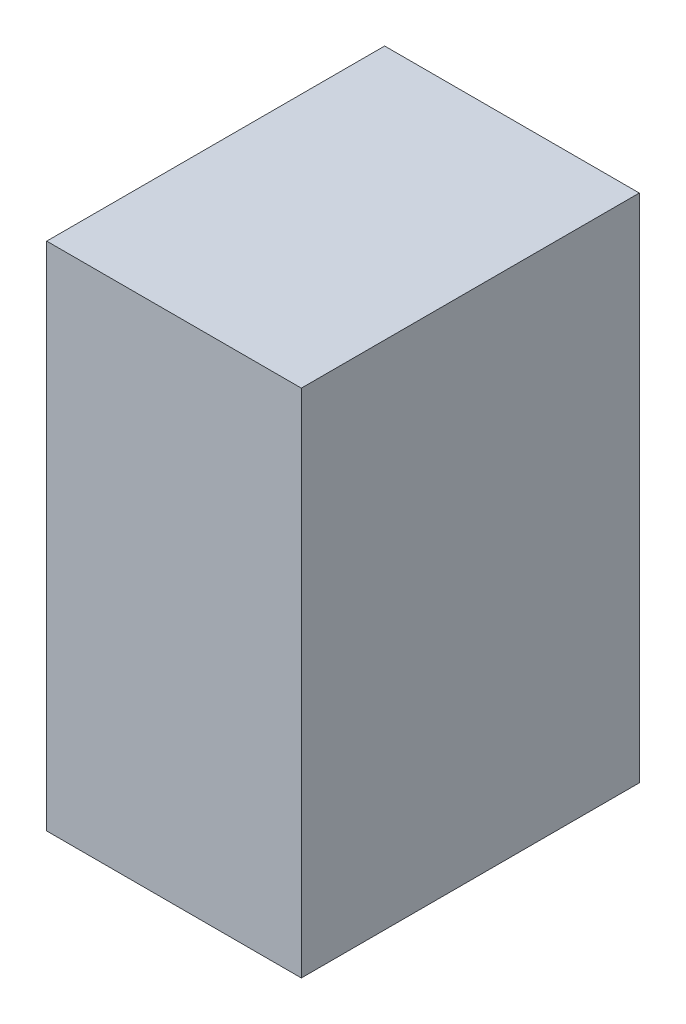
ISO-10303-21;
HEADER;
FILE_DESCRIPTION(('STEP AP214'),'2;1');
FILE_NAME('part.step','',(''),(''),'','','');
FILE_SCHEMA(('AUTOMOTIVE_DESIGN { 1 0 10303 214 1 1 1 1 }'));
ENDSEC;
DATA;
#1=APPLICATION_CONTEXT('core data for automotive mechanical design processes');
#2=APPLICATION_PROTOCOL_DEFINITION('international standard','automotive_design',2000,#1);
#3=PRODUCT_CONTEXT('',#1,'mechanical');
#4=PRODUCT('Part','Part','',(#3));
#5=PRODUCT_RELATED_PRODUCT_CATEGORY('part','',(#4));
#6=PRODUCT_DEFINITION_FORMATION('','',#4);
#7=PRODUCT_DEFINITION_CONTEXT('part definition',#1,'design');
#8=PRODUCT_DEFINITION('design','',#6,#7);
#9=PRODUCT_DEFINITION_SHAPE('','',#8);
#10=(LENGTH_UNIT() NAMED_UNIT(*) SI_UNIT(.MILLI.,.METRE.));
#11=(NAMED_UNIT(*) PLANE_ANGLE_UNIT() SI_UNIT($,.RADIAN.));
#12=(NAMED_UNIT(*) SI_UNIT($,.STERADIAN.) SOLID_ANGLE_UNIT());
#13=UNCERTAINTY_MEASURE_WITH_UNIT(LENGTH_MEASURE(1.E-05),#10,'distance_accuracy_value','');
#14=(GEOMETRIC_REPRESENTATION_CONTEXT(3) GLOBAL_UNCERTAINTY_ASSIGNED_CONTEXT((#13)) GLOBAL_UNIT_ASSIGNED_CONTEXT((#10,
#11,#12)) REPRESENTATION_CONTEXT('',''));
#15=CARTESIAN_POINT('',(0.,0.,0.));
#16=DIRECTION('',(0.,0.,1.));
#17=DIRECTION('',(1.,0.,0.));
#18=AXIS2_PLACEMENT_3D('',#15,#16,#17);
#19=CARTESIAN_POINT('',(0.,0.,27.305));
#20=DIRECTION('',(1.,0.,0.));
#21=DIRECTION('',(0.,1.,0.));
#22=AXIS2_PLACEMENT_3D('',#19,#20,#21);
#23=PLANE('',#22);
#24=DIRECTION('',(0.,-1.,0.));
#25=VECTOR('',#24,1.);
#26=CARTESIAN_POINT('',(0.,0.,0.));
#27=LINE('',#26,#25);
#28=CARTESIAN_POINT('',(0.,41.275,0.));
#29=VERTEX_POINT('',#28);
#30=CARTESIAN_POINT('',(0.,0.,0.));
#31=VERTEX_POINT('',#30);
#32=EDGE_CURVE('E98',#29,#31,#27,.T.);
#33=ORIENTED_EDGE('',*,*,#32,.T.);
#34=DIRECTION('',(0.,0.,-1.));
#35=VECTOR('',#34,1.);
#36=CARTESIAN_POINT('',(0.,0.,27.305));
#37=LINE('',#36,#35);
#38=CARTESIAN_POINT('',(0.,0.,27.305));
#39=VERTEX_POINT('',#38);
#40=EDGE_CURVE('E11',#39,#31,#37,.T.);
#41=ORIENTED_EDGE('',*,*,#40,.F.);
#42=DIRECTION('',(0.,-1.,0.));
#43=VECTOR('',#42,1.);
#44=CARTESIAN_POINT('',(0.,0.,27.305));
#45=LINE('',#44,#43);
#46=CARTESIAN_POINT('',(0.,41.275,27.305));
#47=VERTEX_POINT('',#46);
#48=EDGE_CURVE('E86',#47,#39,#45,.T.);
#49=ORIENTED_EDGE('',*,*,#48,.F.);
#50=DIRECTION('',(0.,0.,-1.));
#51=VECTOR('',#50,1.);
#52=CARTESIAN_POINT('',(0.,41.275,27.305));
#53=LINE('',#52,#51);
#54=EDGE_CURVE('E94',#47,#29,#53,.T.);
#55=ORIENTED_EDGE('',*,*,#54,.T.);
#56=EDGE_LOOP('',(#33,#41,#49,#55));
#57=FACE_BOUND('',#56,.T.);
#58=ADVANCED_FACE('F35',(#57),#23,.F.);
#59=CARTESIAN_POINT('',(0.,0.,27.305));
#60=DIRECTION('',(0.,1.,0.));
#61=DIRECTION('',(0.,0.,1.));
#62=AXIS2_PLACEMENT_3D('',#59,#60,#61);
#63=PLANE('',#62);
#64=DIRECTION('',(1.,0.,0.));
#65=VECTOR('',#64,1.);
#66=CARTESIAN_POINT('',(0.,0.,0.));
#67=LINE('',#66,#65);
#68=CARTESIAN_POINT('',(20.574,0.,0.));
#69=VERTEX_POINT('',#68);
#70=EDGE_CURVE('E90',#31,#69,#67,.T.);
#71=ORIENTED_EDGE('',*,*,#70,.T.);
#72=DIRECTION('',(0.,0.,-1.));
#73=VECTOR('',#72,1.);
#74=CARTESIAN_POINT('',(20.574,0.,27.305));
#75=LINE('',#74,#73);
#76=CARTESIAN_POINT('',(20.574,0.,27.305));
#77=VERTEX_POINT('',#76);
#78=EDGE_CURVE('E43',#77,#69,#75,.T.);
#79=ORIENTED_EDGE('',*,*,#78,.F.);
#80=DIRECTION('',(1.,0.,0.));
#81=VECTOR('',#80,1.);
#82=CARTESIAN_POINT('',(0.,0.,27.305));
#83=LINE('',#82,#81);
#84=EDGE_CURVE('E81',#39,#77,#83,.T.);
#85=ORIENTED_EDGE('',*,*,#84,.F.);
#86=ORIENTED_EDGE('',*,*,#40,.T.);
#87=EDGE_LOOP('',(#71,#79,#85,#86));
#88=FACE_BOUND('',#87,.T.);
#89=ADVANCED_FACE('F89',(#88),#63,.F.);
#90=CARTESIAN_POINT('',(20.574,0.,27.305));
#91=DIRECTION('',(-1.,0.,0.));
#92=DIRECTION('',(0.,-1.,0.));
#93=AXIS2_PLACEMENT_3D('',#90,#91,#92);
#94=PLANE('',#93);
#95=DIRECTION('',(0.,1.,0.));
#96=VECTOR('',#95,1.);
#97=CARTESIAN_POINT('',(20.574,0.,0.));
#98=LINE('',#97,#96);
#99=CARTESIAN_POINT('',(20.574,41.275,0.));
#100=VERTEX_POINT('',#99);
#101=EDGE_CURVE('E68',#69,#100,#98,.T.);
#102=ORIENTED_EDGE('',*,*,#101,.T.);
#103=DIRECTION('',(0.,0.,-1.));
#104=VECTOR('',#103,1.);
#105=CARTESIAN_POINT('',(20.574,41.275,27.305));
#106=LINE('',#105,#104);
#107=CARTESIAN_POINT('',(20.574,41.275,27.305));
#108=VERTEX_POINT('',#107);
#109=EDGE_CURVE('E91',#108,#100,#106,.T.);
#110=ORIENTED_EDGE('',*,*,#109,.F.);
#111=DIRECTION('',(0.,1.,0.));
#112=VECTOR('',#111,1.);
#113=CARTESIAN_POINT('',(20.574,0.,27.305));
#114=LINE('',#113,#112);
#115=EDGE_CURVE('E84',#77,#108,#114,.T.);
#116=ORIENTED_EDGE('',*,*,#115,.F.);
#117=ORIENTED_EDGE('',*,*,#78,.T.);
#118=EDGE_LOOP('',(#102,#110,#116,#117));
#119=FACE_BOUND('',#118,.T.);
#120=ADVANCED_FACE('F92',(#119),#94,.F.);
#121=CARTESIAN_POINT('',(0.,41.275,27.305));
#122=DIRECTION('',(0.,-1.,0.));
#123=DIRECTION('',(0.,0.,-1.));
#124=AXIS2_PLACEMENT_3D('',#121,#122,#123);
#125=PLANE('',#124);
#126=DIRECTION('',(-1.,0.,0.));
#127=VECTOR('',#126,1.);
#128=CARTESIAN_POINT('',(0.,41.275,0.));
#129=LINE('',#128,#127);
#130=EDGE_CURVE('E74',#100,#29,#129,.T.);
#131=ORIENTED_EDGE('',*,*,#130,.T.);
#132=ORIENTED_EDGE('',*,*,#54,.F.);
#133=DIRECTION('',(-1.,0.,0.));
#134=VECTOR('',#133,1.);
#135=CARTESIAN_POINT('',(0.,41.275,27.305));
#136=LINE('',#135,#134);
#137=EDGE_CURVE('E51',#108,#47,#136,.T.);
#138=ORIENTED_EDGE('',*,*,#137,.F.);
#139=ORIENTED_EDGE('',*,*,#109,.T.);
#140=EDGE_LOOP('',(#131,#132,#138,#139));
#141=FACE_BOUND('',#140,.T.);
#142=ADVANCED_FACE('F105',(#141),#125,.F.);
#143=CARTESIAN_POINT('',(0.,0.,27.305));
#144=DIRECTION('',(0.,0.,-1.));
#145=DIRECTION('',(-1.,0.,0.));
#146=AXIS2_PLACEMENT_3D('',#143,#144,#145);
#147=PLANE('',#146);
#148=ORIENTED_EDGE('',*,*,#48,.T.);
#149=ORIENTED_EDGE('',*,*,#84,.T.);
#150=ORIENTED_EDGE('',*,*,#115,.T.);
#151=ORIENTED_EDGE('',*,*,#137,.T.);
#152=EDGE_LOOP('',(#148,#149,#150,#151));
#153=FACE_BOUND('',#152,.T.);
#154=ADVANCED_FACE('F82',(#153),#147,.F.);
#155=CARTESIAN_POINT('',(0.,0.,0.));
#156=DIRECTION('',(0.,0.,-1.));
#157=DIRECTION('',(-1.,0.,0.));
#158=AXIS2_PLACEMENT_3D('',#155,#156,#157);
#159=PLANE('',#158);
#160=ORIENTED_EDGE('',*,*,#32,.F.);
#161=ORIENTED_EDGE('',*,*,#130,.F.);
#162=ORIENTED_EDGE('',*,*,#101,.F.);
#163=ORIENTED_EDGE('',*,*,#70,.F.);
#164=EDGE_LOOP('',(#160,#161,#162,#163));
#165=FACE_BOUND('',#164,.T.);
#166=ADVANCED_FACE('F108',(#165),#159,.T.);
#167=CLOSED_SHELL('',(#58,#89,#120,#142,#154,#166));
#168=MANIFOLD_SOLID_BREP('B2',#167);
#169=ADVANCED_BREP_SHAPE_REPRESENTATION('',(#18,#168),#14);
#170=SHAPE_DEFINITION_REPRESENTATION(#9,#169);
ENDSEC;
END-ISO-10303-21;
